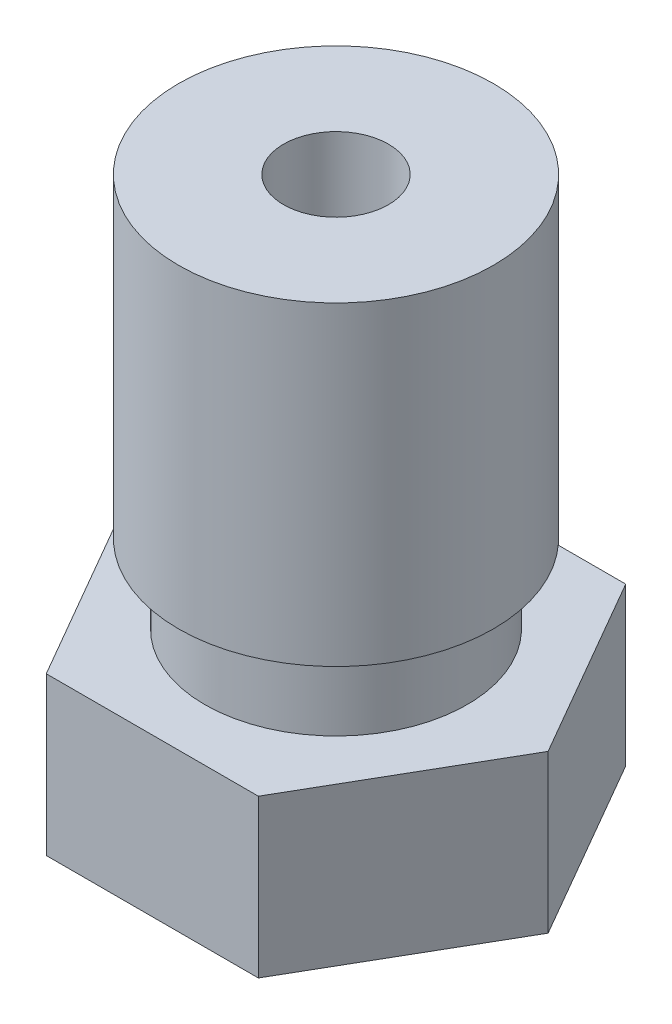
ISO-10303-21;
HEADER;
FILE_DESCRIPTION(('STEP AP214'),'2;1');
FILE_NAME('part.step','',(''),(''),'','','');
FILE_SCHEMA(('AUTOMOTIVE_DESIGN { 1 0 10303 214 1 1 1 1 }'));
ENDSEC;
DATA;
#1=APPLICATION_CONTEXT('core data for automotive mechanical design processes');
#2=APPLICATION_PROTOCOL_DEFINITION('international standard','automotive_design',2000,#1);
#3=PRODUCT_CONTEXT('',#1,'mechanical');
#4=PRODUCT('Part','Part','',(#3));
#5=PRODUCT_RELATED_PRODUCT_CATEGORY('part','',(#4));
#6=PRODUCT_DEFINITION_FORMATION('','',#4);
#7=PRODUCT_DEFINITION_CONTEXT('part definition',#1,'design');
#8=PRODUCT_DEFINITION('design','',#6,#7);
#9=PRODUCT_DEFINITION_SHAPE('','',#8);
#10=(LENGTH_UNIT() NAMED_UNIT(*) SI_UNIT(.MILLI.,.METRE.));
#11=(NAMED_UNIT(*) PLANE_ANGLE_UNIT() SI_UNIT($,.RADIAN.));
#12=(NAMED_UNIT(*) SI_UNIT($,.STERADIAN.) SOLID_ANGLE_UNIT());
#13=UNCERTAINTY_MEASURE_WITH_UNIT(LENGTH_MEASURE(1.E-05),#10,'distance_accuracy_value','');
#14=(GEOMETRIC_REPRESENTATION_CONTEXT(3) GLOBAL_UNCERTAINTY_ASSIGNED_CONTEXT((#13)) GLOBAL_UNIT_ASSIGNED_CONTEXT((#10,
#11,#12)) REPRESENTATION_CONTEXT('',''));
#15=CARTESIAN_POINT('',(0.,0.,0.));
#16=DIRECTION('',(0.,0.,1.));
#17=DIRECTION('',(1.,0.,0.));
#18=AXIS2_PLACEMENT_3D('',#15,#16,#17);
#19=CARTESIAN_POINT('',(0.,3.,0.));
#20=DIRECTION('',(0.,1.,0.));
#21=DIRECTION('',(0.,0.,1.));
#22=AXIS2_PLACEMENT_3D('',#19,#20,#21);
#23=PLANE('',#22);
#24=DIRECTION('',(-0.5,0.,-0.866025403784438));
#25=VECTOR('',#24,1.);
#26=CARTESIAN_POINT('',(4.04145188432738,3.,0.));
#27=LINE('',#26,#25);
#28=CARTESIAN_POINT('',(4.04145188432738,3.,0.));
#29=VERTEX_POINT('',#28);
#30=CARTESIAN_POINT('',(2.02072594216369,3.,-3.5));
#31=VERTEX_POINT('',#30);
#32=EDGE_CURVE('E131',#29,#31,#27,.T.);
#33=ORIENTED_EDGE('',*,*,#32,.T.);
#34=DIRECTION('',(-1.,0.,0.));
#35=VECTOR('',#34,1.);
#36=CARTESIAN_POINT('',(2.02072594216369,3.,-3.5));
#37=LINE('',#36,#35);
#38=CARTESIAN_POINT('',(-2.02072594216369,3.,-3.5));
#39=VERTEX_POINT('',#38);
#40=EDGE_CURVE('E89',#31,#39,#37,.T.);
#41=ORIENTED_EDGE('',*,*,#40,.T.);
#42=DIRECTION('',(-0.5,0.,0.866025403784439));
#43=VECTOR('',#42,1.);
#44=CARTESIAN_POINT('',(-2.02072594216369,3.,-3.5));
#45=LINE('',#44,#43);
#46=CARTESIAN_POINT('',(-4.04145188432738,3.,0.));
#47=VERTEX_POINT('',#46);
#48=EDGE_CURVE('E102',#39,#47,#45,.T.);
#49=ORIENTED_EDGE('',*,*,#48,.T.);
#50=DIRECTION('',(0.5,0.,0.866025403784438));
#51=VECTOR('',#50,1.);
#52=CARTESIAN_POINT('',(-4.04145188432738,3.,0.));
#53=LINE('',#52,#51);
#54=CARTESIAN_POINT('',(-2.02072594216369,3.,3.5));
#55=VERTEX_POINT('',#54);
#56=EDGE_CURVE('E96',#47,#55,#53,.T.);
#57=ORIENTED_EDGE('',*,*,#56,.T.);
#58=DIRECTION('',(1.,0.,0.));
#59=VECTOR('',#58,1.);
#60=CARTESIAN_POINT('',(-2.02072594216369,3.,3.5));
#61=LINE('',#60,#59);
#62=CARTESIAN_POINT('',(2.02072594216369,3.,3.5));
#63=VERTEX_POINT('',#62);
#64=EDGE_CURVE('E100',#55,#63,#61,.T.);
#65=ORIENTED_EDGE('',*,*,#64,.T.);
#66=DIRECTION('',(0.5,0.,-0.866025403784439));
#67=VECTOR('',#66,1.);
#68=CARTESIAN_POINT('',(2.02072594216369,3.,3.5));
#69=LINE('',#68,#67);
#70=EDGE_CURVE('E52',#63,#29,#69,.T.);
#71=ORIENTED_EDGE('',*,*,#70,.T.);
#72=EDGE_LOOP('',(#33,#41,#49,#57,#65,#71));
#73=FACE_BOUND('',#72,.T.);
#74=CARTESIAN_POINT('',(0.,3.,0.));
#75=DIRECTION('',(0.,-1.,0.));
#76=DIRECTION('',(0.,0.,-1.));
#77=AXIS2_PLACEMENT_3D('',#74,#75,#76);
#78=CIRCLE('',#77,2.5);
#79=CARTESIAN_POINT('',(0.,3.,-2.5));
#80=VERTEX_POINT('',#79);
#81=EDGE_CURVE('E217',#80,#80,#78,.T.);
#82=ORIENTED_EDGE('',*,*,#81,.T.);
#83=EDGE_LOOP('',(#82));
#84=FACE_BOUND('',#83,.T.);
#85=ADVANCED_FACE('F35',(#73,#84),#23,.T.);
#86=CARTESIAN_POINT('',(0.,0.,0.));
#87=DIRECTION('',(0.,1.,0.));
#88=DIRECTION('',(0.,0.,1.));
#89=AXIS2_PLACEMENT_3D('',#86,#87,#88);
#90=PLANE('',#89);
#91=CARTESIAN_POINT('',(0.,0.,0.));
#92=DIRECTION('',(0.,-1.,0.));
#93=DIRECTION('',(0.,0.,-1.));
#94=AXIS2_PLACEMENT_3D('',#91,#92,#93);
#95=CIRCLE('',#94,1.90041507641941);
#96=CARTESIAN_POINT('',(0.,0.,-1.90041507641941));
#97=VERTEX_POINT('',#96);
#98=EDGE_CURVE('E195',#97,#97,#95,.T.);
#99=ORIENTED_EDGE('',*,*,#98,.F.);
#100=EDGE_LOOP('',(#99));
#101=FACE_BOUND('',#100,.T.);
#102=DIRECTION('',(-0.5,0.,-0.866025403784438));
#103=VECTOR('',#102,1.);
#104=CARTESIAN_POINT('',(4.04145188432738,0.,0.));
#105=LINE('',#104,#103);
#106=CARTESIAN_POINT('',(4.04145188432738,0.,0.));
#107=VERTEX_POINT('',#106);
#108=CARTESIAN_POINT('',(2.02072594216369,0.,-3.5));
#109=VERTEX_POINT('',#108);
#110=EDGE_CURVE('E120',#107,#109,#105,.T.);
#111=ORIENTED_EDGE('',*,*,#110,.F.);
#112=DIRECTION('',(0.5,0.,-0.866025403784439));
#113=VECTOR('',#112,1.);
#114=CARTESIAN_POINT('',(2.02072594216369,0.,3.5));
#115=LINE('',#114,#113);
#116=CARTESIAN_POINT('',(2.02072594216369,0.,3.5));
#117=VERTEX_POINT('',#116);
#118=EDGE_CURVE('E81',#117,#107,#115,.T.);
#119=ORIENTED_EDGE('',*,*,#118,.F.);
#120=DIRECTION('',(1.,0.,0.));
#121=VECTOR('',#120,1.);
#122=CARTESIAN_POINT('',(-2.02072594216369,0.,3.5));
#123=LINE('',#122,#121);
#124=CARTESIAN_POINT('',(-2.02072594216369,0.,3.5));
#125=VERTEX_POINT('',#124);
#126=EDGE_CURVE('E75',#125,#117,#123,.T.);
#127=ORIENTED_EDGE('',*,*,#126,.F.);
#128=DIRECTION('',(0.5,0.,0.866025403784438));
#129=VECTOR('',#128,1.);
#130=CARTESIAN_POINT('',(-4.04145188432738,0.,0.));
#131=LINE('',#130,#129);
#132=CARTESIAN_POINT('',(-4.04145188432738,0.,0.));
#133=VERTEX_POINT('',#132);
#134=EDGE_CURVE('E110',#133,#125,#131,.T.);
#135=ORIENTED_EDGE('',*,*,#134,.F.);
#136=DIRECTION('',(-0.5,0.,0.866025403784439));
#137=VECTOR('',#136,1.);
#138=CARTESIAN_POINT('',(-2.02072594216369,0.,-3.5));
#139=LINE('',#138,#137);
#140=CARTESIAN_POINT('',(-2.02072594216369,0.,-3.5));
#141=VERTEX_POINT('',#140);
#142=EDGE_CURVE('E126',#141,#133,#139,.T.);
#143=ORIENTED_EDGE('',*,*,#142,.F.);
#144=DIRECTION('',(-1.,0.,0.));
#145=VECTOR('',#144,1.);
#146=CARTESIAN_POINT('',(2.02072594216369,0.,-3.5));
#147=LINE('',#146,#145);
#148=EDGE_CURVE('E123',#109,#141,#147,.T.);
#149=ORIENTED_EDGE('',*,*,#148,.F.);
#150=EDGE_LOOP('',(#111,#119,#127,#135,#143,#149));
#151=FACE_BOUND('',#150,.T.);
#152=ADVANCED_FACE('F140',(#101,#151),#90,.F.);
#153=CARTESIAN_POINT('',(4.04145188432738,3.,0.));
#154=DIRECTION('',(-0.866025403784438,0.,0.5));
#155=DIRECTION('',(0.5,0.,0.866025403784439));
#156=AXIS2_PLACEMENT_3D('',#153,#154,#155);
#157=PLANE('',#156);
#158=ORIENTED_EDGE('',*,*,#110,.T.);
#159=DIRECTION('',(0.,-1.,0.));
#160=VECTOR('',#159,1.);
#161=CARTESIAN_POINT('',(2.02072594216369,3.,-3.5));
#162=LINE('',#161,#160);
#163=EDGE_CURVE('E11',#31,#109,#162,.T.);
#164=ORIENTED_EDGE('',*,*,#163,.F.);
#165=ORIENTED_EDGE('',*,*,#32,.F.);
#166=DIRECTION('',(0.,-1.,0.));
#167=VECTOR('',#166,1.);
#168=CARTESIAN_POINT('',(4.04145188432738,3.,0.));
#169=LINE('',#168,#167);
#170=EDGE_CURVE('E116',#29,#107,#169,.T.);
#171=ORIENTED_EDGE('',*,*,#170,.T.);
#172=EDGE_LOOP('',(#158,#164,#165,#171));
#173=FACE_BOUND('',#172,.T.);
#174=ADVANCED_FACE('F37',(#173),#157,.F.);
#175=CARTESIAN_POINT('',(2.02072594216369,3.,-3.5));
#176=DIRECTION('',(0.,0.,1.));
#177=DIRECTION('',(1.,0.,0.));
#178=AXIS2_PLACEMENT_3D('',#175,#176,#177);
#179=PLANE('',#178);
#180=ORIENTED_EDGE('',*,*,#148,.T.);
#181=DIRECTION('',(0.,-1.,0.));
#182=VECTOR('',#181,1.);
#183=CARTESIAN_POINT('',(-2.02072594216369,3.,-3.5));
#184=LINE('',#183,#182);
#185=EDGE_CURVE('E44',#39,#141,#184,.T.);
#186=ORIENTED_EDGE('',*,*,#185,.F.);
#187=ORIENTED_EDGE('',*,*,#40,.F.);
#188=ORIENTED_EDGE('',*,*,#163,.T.);
#189=EDGE_LOOP('',(#180,#186,#187,#188));
#190=FACE_BOUND('',#189,.T.);
#191=ADVANCED_FACE('F305',(#190),#179,.F.);
#192=CARTESIAN_POINT('',(-2.02072594216369,3.,-3.5));
#193=DIRECTION('',(0.866025403784439,0.,0.5));
#194=DIRECTION('',(0.5,0.,-0.866025403784439));
#195=AXIS2_PLACEMENT_3D('',#192,#193,#194);
#196=PLANE('',#195);
#197=ORIENTED_EDGE('',*,*,#142,.T.);
#198=DIRECTION('',(0.,-1.,0.));
#199=VECTOR('',#198,1.);
#200=CARTESIAN_POINT('',(-4.04145188432738,3.,0.));
#201=LINE('',#200,#199);
#202=EDGE_CURVE('E111',#47,#133,#201,.T.);
#203=ORIENTED_EDGE('',*,*,#202,.F.);
#204=ORIENTED_EDGE('',*,*,#48,.F.);
#205=ORIENTED_EDGE('',*,*,#185,.T.);
#206=EDGE_LOOP('',(#197,#203,#204,#205));
#207=FACE_BOUND('',#206,.T.);
#208=ADVANCED_FACE('F137',(#207),#196,.F.);
#209=CARTESIAN_POINT('',(-4.04145188432738,3.,0.));
#210=DIRECTION('',(0.866025403784438,0.,-0.5));
#211=DIRECTION('',(-0.5,0.,-0.866025403784439));
#212=AXIS2_PLACEMENT_3D('',#209,#210,#211);
#213=PLANE('',#212);
#214=ORIENTED_EDGE('',*,*,#134,.T.);
#215=DIRECTION('',(0.,-1.,0.));
#216=VECTOR('',#215,1.);
#217=CARTESIAN_POINT('',(-2.02072594216369,3.,3.5));
#218=LINE('',#217,#216);
#219=EDGE_CURVE('E107',#55,#125,#218,.T.);
#220=ORIENTED_EDGE('',*,*,#219,.F.);
#221=ORIENTED_EDGE('',*,*,#56,.F.);
#222=ORIENTED_EDGE('',*,*,#202,.T.);
#223=EDGE_LOOP('',(#214,#220,#221,#222));
#224=FACE_BOUND('',#223,.T.);
#225=ADVANCED_FACE('F108',(#224),#213,.F.);
#226=CARTESIAN_POINT('',(-2.02072594216369,3.,3.5));
#227=DIRECTION('',(0.,0.,-1.));
#228=DIRECTION('',(-1.,0.,0.));
#229=AXIS2_PLACEMENT_3D('',#226,#227,#228);
#230=PLANE('',#229);
#231=ORIENTED_EDGE('',*,*,#126,.T.);
#232=DIRECTION('',(0.,-1.,0.));
#233=VECTOR('',#232,1.);
#234=CARTESIAN_POINT('',(2.02072594216369,3.,3.5));
#235=LINE('',#234,#233);
#236=EDGE_CURVE('E112',#63,#117,#235,.T.);
#237=ORIENTED_EDGE('',*,*,#236,.F.);
#238=ORIENTED_EDGE('',*,*,#64,.F.);
#239=ORIENTED_EDGE('',*,*,#219,.T.);
#240=EDGE_LOOP('',(#231,#237,#238,#239));
#241=FACE_BOUND('',#240,.T.);
#242=ADVANCED_FACE('F114',(#241),#230,.F.);
#243=CARTESIAN_POINT('',(2.02072594216369,3.,3.5));
#244=DIRECTION('',(-0.866025403784438,0.,-0.5));
#245=DIRECTION('',(-0.5,0.,0.866025403784439));
#246=AXIS2_PLACEMENT_3D('',#243,#244,#245);
#247=PLANE('',#246);
#248=ORIENTED_EDGE('',*,*,#118,.T.);
#249=ORIENTED_EDGE('',*,*,#170,.F.);
#250=ORIENTED_EDGE('',*,*,#70,.F.);
#251=ORIENTED_EDGE('',*,*,#236,.T.);
#252=EDGE_LOOP('',(#248,#249,#250,#251));
#253=FACE_BOUND('',#252,.T.);
#254=ADVANCED_FACE('F144',(#253),#247,.F.);
#255=CARTESIAN_POINT('',(0.,3.,0.));
#256=DIRECTION('',(0.,-1.,0.));
#257=DIRECTION('',(0.,0.,-1.));
#258=AXIS2_PLACEMENT_3D('',#255,#256,#257);
#259=CYLINDRICAL_SURFACE('',#258,1.);
#260=CARTESIAN_POINT('',(0.,0.,0.));
#261=DIRECTION('',(0.,1.,0.));
#262=DIRECTION('',(0.,0.,1.));
#263=AXIS2_PLACEMENT_3D('',#260,#261,#262);
#264=CIRCLE('',#263,1.);
#265=CARTESIAN_POINT('',(0.,0.,1.));
#266=VERTEX_POINT('',#265);
#267=EDGE_CURVE('E124',#266,#266,#264,.T.);
#268=ORIENTED_EDGE('',*,*,#267,.F.);
#269=EDGE_LOOP('',(#268));
#270=FACE_BOUND('',#269,.T.);
#271=CARTESIAN_POINT('',(0.,10.5,0.));
#272=DIRECTION('',(0.,-1.,0.));
#273=DIRECTION('',(0.,0.,-1.));
#274=AXIS2_PLACEMENT_3D('',#271,#272,#273);
#275=CIRCLE('',#274,1.);
#276=CARTESIAN_POINT('',(0.,10.5,-1.));
#277=VERTEX_POINT('',#276);
#278=EDGE_CURVE('E202',#277,#277,#275,.T.);
#279=ORIENTED_EDGE('',*,*,#278,.F.);
#280=EDGE_LOOP('',(#279));
#281=FACE_BOUND('',#280,.T.);
#282=ADVANCED_FACE('F146',(#270,#281),#259,.F.);
#283=CARTESIAN_POINT('',(0.,-2.,0.));
#284=DIRECTION('',(0.,-1.,0.));
#285=DIRECTION('',(0.,0.,-1.));
#286=AXIS2_PLACEMENT_3D('',#283,#284,#285);
#287=CYLINDRICAL_SURFACE('',#286,2.5);
#288=ORIENTED_EDGE('',*,*,#81,.F.);
#289=EDGE_LOOP('',(#288));
#290=FACE_BOUND('',#289,.T.);
#291=CARTESIAN_POINT('',(0.,4.5,0.));
#292=DIRECTION('',(0.,-1.,0.));
#293=DIRECTION('',(0.,0.,-1.));
#294=AXIS2_PLACEMENT_3D('',#291,#292,#293);
#295=CIRCLE('',#294,2.5);
#296=CARTESIAN_POINT('',(0.,4.5,-2.5));
#297=VERTEX_POINT('',#296);
#298=EDGE_CURVE('E214',#297,#297,#295,.T.);
#299=ORIENTED_EDGE('',*,*,#298,.T.);
#300=EDGE_LOOP('',(#299));
#301=FACE_BOUND('',#300,.T.);
#302=ADVANCED_FACE('F152',(#290,#301),#287,.T.);
#303=CARTESIAN_POINT('',(0.,4.5,0.));
#304=DIRECTION('',(0.,1.,0.));
#305=DIRECTION('',(0.,0.,1.));
#306=AXIS2_PLACEMENT_3D('',#303,#304,#305);
#307=PLANE('',#306);
#308=ORIENTED_EDGE('',*,*,#298,.F.);
#309=EDGE_LOOP('',(#308));
#310=FACE_BOUND('',#309,.T.);
#311=CARTESIAN_POINT('',(0.,4.5,0.));
#312=DIRECTION('',(0.,-1.,0.));
#313=DIRECTION('',(0.,0.,-1.));
#314=AXIS2_PLACEMENT_3D('',#311,#312,#313);
#315=CIRCLE('',#314,3.);
#316=CARTESIAN_POINT('',(0.,4.5,-3.));
#317=VERTEX_POINT('',#316);
#318=EDGE_CURVE('E211',#317,#317,#315,.T.);
#319=ORIENTED_EDGE('',*,*,#318,.T.);
#320=EDGE_LOOP('',(#319));
#321=FACE_BOUND('',#320,.T.);
#322=ADVANCED_FACE('F166',(#310,#321),#307,.F.);
#323=CARTESIAN_POINT('',(0.,-2.,0.));
#324=DIRECTION('',(0.,-1.,0.));
#325=DIRECTION('',(0.,0.,-1.));
#326=AXIS2_PLACEMENT_3D('',#323,#324,#325);
#327=CYLINDRICAL_SURFACE('',#326,3.);
#328=ORIENTED_EDGE('',*,*,#318,.F.);
#329=EDGE_LOOP('',(#328));
#330=FACE_BOUND('',#329,.T.);
#331=CARTESIAN_POINT('',(0.,10.5,0.));
#332=DIRECTION('',(0.,-1.,0.));
#333=DIRECTION('',(0.,0.,-1.));
#334=AXIS2_PLACEMENT_3D('',#331,#332,#333);
#335=CIRCLE('',#334,3.);
#336=CARTESIAN_POINT('',(0.,10.5,-3.));
#337=VERTEX_POINT('',#336);
#338=EDGE_CURVE('E208',#337,#337,#335,.T.);
#339=ORIENTED_EDGE('',*,*,#338,.T.);
#340=EDGE_LOOP('',(#339));
#341=FACE_BOUND('',#340,.T.);
#342=ADVANCED_FACE('F170',(#330,#341),#327,.T.);
#343=CARTESIAN_POINT('',(0.,10.5,0.));
#344=DIRECTION('',(0.,-1.,0.));
#345=DIRECTION('',(0.,0.,-1.));
#346=AXIS2_PLACEMENT_3D('',#343,#344,#345);
#347=PLANE('',#346);
#348=ORIENTED_EDGE('',*,*,#338,.F.);
#349=EDGE_LOOP('',(#348));
#350=FACE_BOUND('',#349,.T.);
#351=ORIENTED_EDGE('',*,*,#278,.T.);
#352=EDGE_LOOP('',(#351));
#353=FACE_BOUND('',#352,.T.);
#354=ADVANCED_FACE('F174',(#350,#353),#347,.F.);
#355=CARTESIAN_POINT('',(0.,0.,0.));
#356=DIRECTION('',(0.,1.,0.));
#357=DIRECTION('',(0.,0.,1.));
#358=AXIS2_PLACEMENT_3D('',#355,#356,#357);
#359=CONICAL_SURFACE('',#358,1.,0.380506377112365);
#360=CARTESIAN_POINT('',(0.,-2.,0.));
#361=DIRECTION('',(0.,-1.,0.));
#362=DIRECTION('',(0.,0.,-1.));
#363=AXIS2_PLACEMENT_3D('',#360,#361,#362);
#364=CIRCLE('',#363,0.2);
#365=CARTESIAN_POINT('',(0.,-2.,-0.2));
#366=VERTEX_POINT('',#365);
#367=EDGE_CURVE('E199',#366,#366,#364,.T.);
#368=ORIENTED_EDGE('',*,*,#367,.T.);
#369=EDGE_LOOP('',(#368));
#370=FACE_BOUND('',#369,.T.);
#371=ORIENTED_EDGE('',*,*,#267,.T.);
#372=EDGE_LOOP('',(#371));
#373=FACE_BOUND('',#372,.T.);
#374=ADVANCED_FACE('F178',(#370,#373),#359,.F.);
#375=CARTESIAN_POINT('',(0.,-2.,0.));
#376=DIRECTION('',(0.,-1.,0.));
#377=DIRECTION('',(0.,0.,-1.));
#378=AXIS2_PLACEMENT_3D('',#375,#376,#377);
#379=PLANE('',#378);
#380=CARTESIAN_POINT('',(0.,-2.,0.));
#381=DIRECTION('',(0.,-1.,0.));
#382=DIRECTION('',(0.,0.,-1.));
#383=AXIS2_PLACEMENT_3D('',#380,#381,#382);
#384=CIRCLE('',#383,0.5);
#385=CARTESIAN_POINT('',(0.,-2.,-0.5));
#386=VERTEX_POINT('',#385);
#387=EDGE_CURVE('E198',#386,#386,#384,.T.);
#388=ORIENTED_EDGE('',*,*,#387,.T.);
#389=EDGE_LOOP('',(#388));
#390=FACE_BOUND('',#389,.T.);
#391=ORIENTED_EDGE('',*,*,#367,.F.);
#392=EDGE_LOOP('',(#391));
#393=FACE_BOUND('',#392,.T.);
#394=ADVANCED_FACE('F182',(#390,#393),#379,.T.);
#395=CARTESIAN_POINT('',(0.,-2.,0.));
#396=DIRECTION('',(0.,1.,0.));
#397=DIRECTION('',(0.,0.,1.));
#398=AXIS2_PLACEMENT_3D('',#395,#396,#397);
#399=CONICAL_SURFACE('',#398,0.5,0.610865238198013);
#400=ORIENTED_EDGE('',*,*,#98,.T.);
#401=EDGE_LOOP('',(#400));
#402=FACE_BOUND('',#401,.T.);
#403=ORIENTED_EDGE('',*,*,#387,.F.);
#404=EDGE_LOOP('',(#403));
#405=FACE_BOUND('',#404,.T.);
#406=ADVANCED_FACE('F186',(#402,#405),#399,.T.);
#407=CLOSED_SHELL('',(#85,#152,#174,#191,#208,#225,#242,#254,#282,#302,#322,#342,#354,#374,#394,#406));
#408=MANIFOLD_SOLID_BREP('B2',#407);
#409=ADVANCED_BREP_SHAPE_REPRESENTATION('',(#18,#408),#14);
#410=SHAPE_DEFINITION_REPRESENTATION(#9,#409);
ENDSEC;
END-ISO-10303-21;
